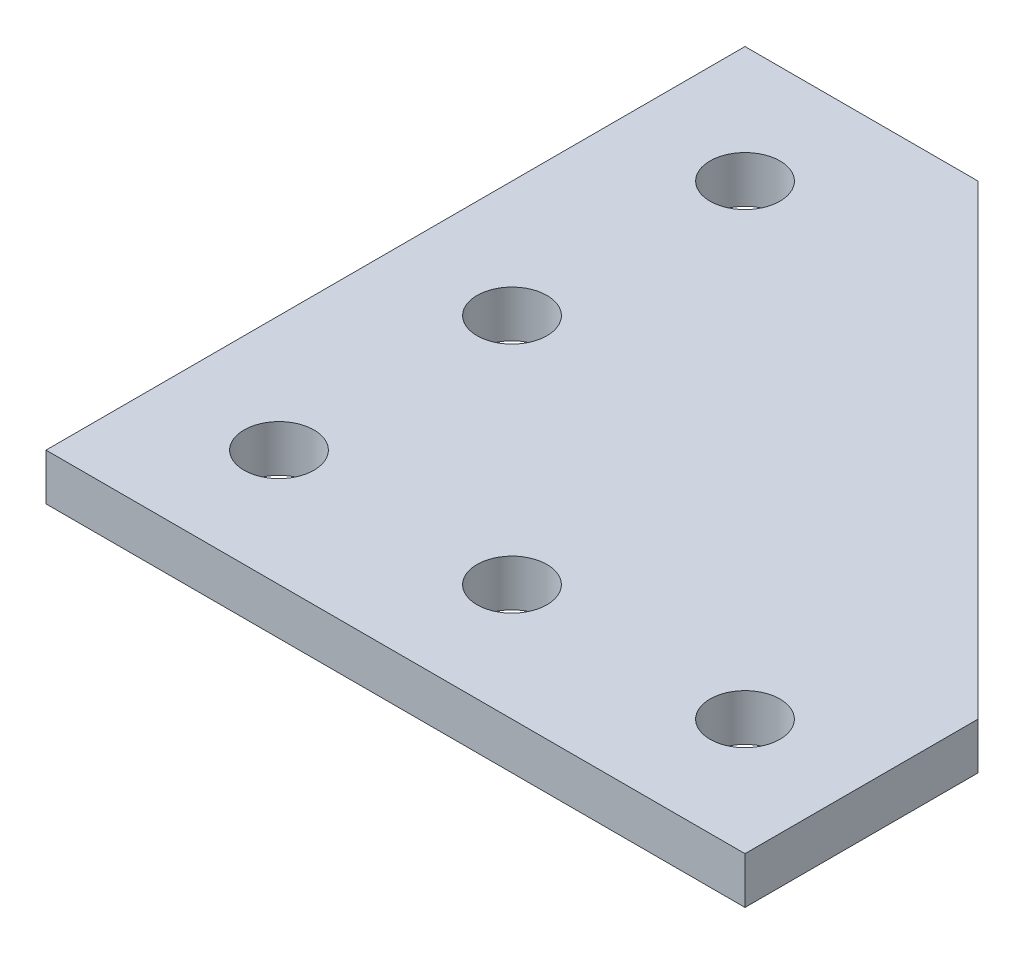
ISO-10303-21;
HEADER;
FILE_DESCRIPTION(('STEP AP214'),'2;1');
FILE_NAME('part.step','',(''),(''),'','','');
FILE_SCHEMA(('AUTOMOTIVE_DESIGN { 1 0 10303 214 1 1 1 1 }'));
ENDSEC;
DATA;
#1=APPLICATION_CONTEXT('core data for automotive mechanical design processes');
#2=APPLICATION_PROTOCOL_DEFINITION('international standard','automotive_design',2000,#1);
#3=PRODUCT_CONTEXT('',#1,'mechanical');
#4=PRODUCT('Part','Part','',(#3));
#5=PRODUCT_RELATED_PRODUCT_CATEGORY('part','',(#4));
#6=PRODUCT_DEFINITION_FORMATION('','',#4);
#7=PRODUCT_DEFINITION_CONTEXT('part definition',#1,'design');
#8=PRODUCT_DEFINITION('design','',#6,#7);
#9=PRODUCT_DEFINITION_SHAPE('','',#8);
#10=(LENGTH_UNIT() NAMED_UNIT(*) SI_UNIT(.MILLI.,.METRE.));
#11=(NAMED_UNIT(*) PLANE_ANGLE_UNIT() SI_UNIT($,.RADIAN.));
#12=(NAMED_UNIT(*) SI_UNIT($,.STERADIAN.) SOLID_ANGLE_UNIT());
#13=UNCERTAINTY_MEASURE_WITH_UNIT(LENGTH_MEASURE(1.E-05),#10,'distance_accuracy_value','');
#14=(GEOMETRIC_REPRESENTATION_CONTEXT(3) GLOBAL_UNCERTAINTY_ASSIGNED_CONTEXT((#13)) GLOBAL_UNIT_ASSIGNED_CONTEXT((#10,
#11,#12)) REPRESENTATION_CONTEXT('',''));
#15=CARTESIAN_POINT('',(0.,0.,0.));
#16=DIRECTION('',(0.,0.,1.));
#17=DIRECTION('',(1.,0.,0.));
#18=AXIS2_PLACEMENT_3D('',#15,#16,#17);
#19=CARTESIAN_POINT('',(60.,4.,0.));
#20=DIRECTION('',(0.,0.,-1.));
#21=DIRECTION('',(-1.,0.,0.));
#22=AXIS2_PLACEMENT_3D('',#19,#20,#21);
#23=PLANE('',#22);
#24=DIRECTION('',(1.,0.,0.));
#25=VECTOR('',#24,1.);
#26=CARTESIAN_POINT('',(60.,0.,0.));
#27=LINE('',#26,#25);
#28=CARTESIAN_POINT('',(0.,0.,0.));
#29=VERTEX_POINT('',#28);
#30=CARTESIAN_POINT('',(60.,0.,0.));
#31=VERTEX_POINT('',#30);
#32=EDGE_CURVE('E115',#29,#31,#27,.T.);
#33=ORIENTED_EDGE('',*,*,#32,.T.);
#34=DIRECTION('',(0.,-1.,0.));
#35=VECTOR('',#34,1.);
#36=CARTESIAN_POINT('',(60.,4.,0.));
#37=LINE('',#36,#35);
#38=CARTESIAN_POINT('',(60.,4.,0.));
#39=VERTEX_POINT('',#38);
#40=EDGE_CURVE('E11',#39,#31,#37,.T.);
#41=ORIENTED_EDGE('',*,*,#40,.F.);
#42=DIRECTION('',(1.,0.,0.));
#43=VECTOR('',#42,1.);
#44=CARTESIAN_POINT('',(60.,4.,0.));
#45=LINE('',#44,#43);
#46=CARTESIAN_POINT('',(0.,4.,0.));
#47=VERTEX_POINT('',#46);
#48=EDGE_CURVE('E124',#47,#39,#45,.T.);
#49=ORIENTED_EDGE('',*,*,#48,.F.);
#50=DIRECTION('',(0.,-1.,0.));
#51=VECTOR('',#50,1.);
#52=CARTESIAN_POINT('',(0.,4.,0.));
#53=LINE('',#52,#51);
#54=EDGE_CURVE('E111',#47,#29,#53,.T.);
#55=ORIENTED_EDGE('',*,*,#54,.T.);
#56=EDGE_LOOP('',(#33,#41,#49,#55));
#57=FACE_BOUND('',#56,.T.);
#58=ADVANCED_FACE('F41',(#57),#23,.F.);
#59=CARTESIAN_POINT('',(60.,4.,-20.));
#60=DIRECTION('',(-1.,0.,0.));
#61=DIRECTION('',(0.,0.,1.));
#62=AXIS2_PLACEMENT_3D('',#59,#60,#61);
#63=PLANE('',#62);
#64=DIRECTION('',(0.,0.,-1.));
#65=VECTOR('',#64,1.);
#66=CARTESIAN_POINT('',(60.,0.,-20.));
#67=LINE('',#66,#65);
#68=CARTESIAN_POINT('',(60.,0.,-20.));
#69=VERTEX_POINT('',#68);
#70=EDGE_CURVE('E118',#31,#69,#67,.T.);
#71=ORIENTED_EDGE('',*,*,#70,.T.);
#72=DIRECTION('',(0.,-1.,0.));
#73=VECTOR('',#72,1.);
#74=CARTESIAN_POINT('',(60.,4.,-20.));
#75=LINE('',#74,#73);
#76=CARTESIAN_POINT('',(60.,4.,-20.));
#77=VERTEX_POINT('',#76);
#78=EDGE_CURVE('E49',#77,#69,#75,.T.);
#79=ORIENTED_EDGE('',*,*,#78,.F.);
#80=DIRECTION('',(0.,0.,-1.));
#81=VECTOR('',#80,1.);
#82=CARTESIAN_POINT('',(60.,4.,-20.));
#83=LINE('',#82,#81);
#84=EDGE_CURVE('E91',#39,#77,#83,.T.);
#85=ORIENTED_EDGE('',*,*,#84,.F.);
#86=ORIENTED_EDGE('',*,*,#40,.T.);
#87=EDGE_LOOP('',(#71,#79,#85,#86));
#88=FACE_BOUND('',#87,.T.);
#89=ADVANCED_FACE('F144',(#88),#63,.F.);
#90=CARTESIAN_POINT('',(20.,4.,-60.));
#91=DIRECTION('',(-0.707106781186547,0.,0.707106781186547));
#92=DIRECTION('',(0.707106781186548,0.,0.707106781186548));
#93=AXIS2_PLACEMENT_3D('',#90,#91,#92);
#94=PLANE('',#93);
#95=DIRECTION('',(-0.707106781186548,0.,-0.707106781186548));
#96=VECTOR('',#95,1.);
#97=CARTESIAN_POINT('',(20.,0.,-60.));
#98=LINE('',#97,#96);
#99=CARTESIAN_POINT('',(20.,0.,-60.));
#100=VERTEX_POINT('',#99);
#101=EDGE_CURVE('E106',#69,#100,#98,.T.);
#102=ORIENTED_EDGE('',*,*,#101,.T.);
#103=DIRECTION('',(0.,-1.,0.));
#104=VECTOR('',#103,1.);
#105=CARTESIAN_POINT('',(20.,4.,-60.));
#106=LINE('',#105,#104);
#107=CARTESIAN_POINT('',(20.,4.,-60.));
#108=VERTEX_POINT('',#107);
#109=EDGE_CURVE('E103',#108,#100,#106,.T.);
#110=ORIENTED_EDGE('',*,*,#109,.F.);
#111=DIRECTION('',(-0.707106781186548,0.,-0.707106781186548));
#112=VECTOR('',#111,1.);
#113=CARTESIAN_POINT('',(20.,4.,-60.));
#114=LINE('',#113,#112);
#115=EDGE_CURVE('E95',#77,#108,#114,.T.);
#116=ORIENTED_EDGE('',*,*,#115,.F.);
#117=ORIENTED_EDGE('',*,*,#78,.T.);
#118=EDGE_LOOP('',(#102,#110,#116,#117));
#119=FACE_BOUND('',#118,.T.);
#120=ADVANCED_FACE('F104',(#119),#94,.F.);
#121=CARTESIAN_POINT('',(0.,4.,-60.));
#122=DIRECTION('',(0.,0.,1.));
#123=DIRECTION('',(1.,0.,0.));
#124=AXIS2_PLACEMENT_3D('',#121,#122,#123);
#125=PLANE('',#124);
#126=DIRECTION('',(-1.,0.,0.));
#127=VECTOR('',#126,1.);
#128=CARTESIAN_POINT('',(0.,0.,-60.));
#129=LINE('',#128,#127);
#130=CARTESIAN_POINT('',(0.,0.,-60.));
#131=VERTEX_POINT('',#130);
#132=EDGE_CURVE('E77',#100,#131,#129,.T.);
#133=ORIENTED_EDGE('',*,*,#132,.T.);
#134=DIRECTION('',(0.,-1.,0.));
#135=VECTOR('',#134,1.);
#136=CARTESIAN_POINT('',(0.,4.,-60.));
#137=LINE('',#136,#135);
#138=CARTESIAN_POINT('',(0.,4.,-60.));
#139=VERTEX_POINT('',#138);
#140=EDGE_CURVE('E107',#139,#131,#137,.T.);
#141=ORIENTED_EDGE('',*,*,#140,.F.);
#142=DIRECTION('',(-1.,0.,0.));
#143=VECTOR('',#142,1.);
#144=CARTESIAN_POINT('',(0.,4.,-60.));
#145=LINE('',#144,#143);
#146=EDGE_CURVE('E99',#108,#139,#145,.T.);
#147=ORIENTED_EDGE('',*,*,#146,.F.);
#148=ORIENTED_EDGE('',*,*,#109,.T.);
#149=EDGE_LOOP('',(#133,#141,#147,#148));
#150=FACE_BOUND('',#149,.T.);
#151=ADVANCED_FACE('F109',(#150),#125,.F.);
#152=CARTESIAN_POINT('',(0.,4.,0.));
#153=DIRECTION('',(1.,0.,0.));
#154=DIRECTION('',(0.,0.,-1.));
#155=AXIS2_PLACEMENT_3D('',#152,#153,#154);
#156=PLANE('',#155);
#157=DIRECTION('',(0.,0.,1.));
#158=VECTOR('',#157,1.);
#159=CARTESIAN_POINT('',(0.,0.,0.));
#160=LINE('',#159,#158);
#161=EDGE_CURVE('E83',#131,#29,#160,.T.);
#162=ORIENTED_EDGE('',*,*,#161,.T.);
#163=ORIENTED_EDGE('',*,*,#54,.F.);
#164=DIRECTION('',(0.,0.,1.));
#165=VECTOR('',#164,1.);
#166=CARTESIAN_POINT('',(0.,4.,0.));
#167=LINE('',#166,#165);
#168=EDGE_CURVE('E57',#139,#47,#167,.T.);
#169=ORIENTED_EDGE('',*,*,#168,.F.);
#170=ORIENTED_EDGE('',*,*,#140,.T.);
#171=EDGE_LOOP('',(#162,#163,#169,#170));
#172=FACE_BOUND('',#171,.T.);
#173=ADVANCED_FACE('F132',(#172),#156,.F.);
#174=CARTESIAN_POINT('',(0.,4.,0.));
#175=DIRECTION('',(0.,-1.,0.));
#176=DIRECTION('',(0.,0.,-1.));
#177=AXIS2_PLACEMENT_3D('',#174,#175,#176);
#178=PLANE('',#177);
#179=CARTESIAN_POINT('',(9.99999999999999,4.,-30.));
#180=DIRECTION('',(0.,1.,0.));
#181=DIRECTION('',(0.,0.,-1.));
#182=AXIS2_PLACEMENT_3D('',#179,#180,#181);
#183=CIRCLE('',#182,3.);
#184=CARTESIAN_POINT('',(9.99999999999999,4.,-33.));
#185=VERTEX_POINT('',#184);
#186=EDGE_CURVE('E250',#185,#185,#183,.T.);
#187=ORIENTED_EDGE('',*,*,#186,.F.);
#188=EDGE_LOOP('',(#187));
#189=FACE_BOUND('',#188,.T.);
#190=CARTESIAN_POINT('',(9.99999999999999,4.,-50.));
#191=DIRECTION('',(0.,1.,0.));
#192=DIRECTION('',(0.,0.,-1.));
#193=AXIS2_PLACEMENT_3D('',#190,#191,#192);
#194=CIRCLE('',#193,3.);
#195=CARTESIAN_POINT('',(9.99999999999999,4.,-53.));
#196=VERTEX_POINT('',#195);
#197=EDGE_CURVE('E254',#196,#196,#194,.T.);
#198=ORIENTED_EDGE('',*,*,#197,.F.);
#199=EDGE_LOOP('',(#198));
#200=FACE_BOUND('',#199,.T.);
#201=CARTESIAN_POINT('',(50.,4.,-10.));
#202=DIRECTION('',(0.,1.,0.));
#203=DIRECTION('',(0.,0.,1.));
#204=AXIS2_PLACEMENT_3D('',#201,#202,#203);
#205=CIRCLE('',#204,3.);
#206=CARTESIAN_POINT('',(50.,4.,-7.));
#207=VERTEX_POINT('',#206);
#208=EDGE_CURVE('E273',#207,#207,#205,.T.);
#209=ORIENTED_EDGE('',*,*,#208,.F.);
#210=EDGE_LOOP('',(#209));
#211=FACE_BOUND('',#210,.T.);
#212=CARTESIAN_POINT('',(10.,4.,-10.));
#213=DIRECTION('',(0.,1.,0.));
#214=DIRECTION('',(0.,0.,1.));
#215=AXIS2_PLACEMENT_3D('',#212,#213,#214);
#216=CIRCLE('',#215,3.);
#217=CARTESIAN_POINT('',(10.,4.,-7.));
#218=VERTEX_POINT('',#217);
#219=EDGE_CURVE('E264',#218,#218,#216,.T.);
#220=ORIENTED_EDGE('',*,*,#219,.F.);
#221=EDGE_LOOP('',(#220));
#222=FACE_BOUND('',#221,.T.);
#223=CARTESIAN_POINT('',(30.,4.,-10.));
#224=DIRECTION('',(0.,1.,0.));
#225=DIRECTION('',(0.,0.,1.));
#226=AXIS2_PLACEMENT_3D('',#223,#224,#225);
#227=CIRCLE('',#226,3.);
#228=CARTESIAN_POINT('',(30.,4.,-7.));
#229=VERTEX_POINT('',#228);
#230=EDGE_CURVE('E261',#229,#229,#227,.T.);
#231=ORIENTED_EDGE('',*,*,#230,.F.);
#232=EDGE_LOOP('',(#231));
#233=FACE_BOUND('',#232,.T.);
#234=ORIENTED_EDGE('',*,*,#48,.T.);
#235=ORIENTED_EDGE('',*,*,#84,.T.);
#236=ORIENTED_EDGE('',*,*,#115,.T.);
#237=ORIENTED_EDGE('',*,*,#146,.T.);
#238=ORIENTED_EDGE('',*,*,#168,.T.);
#239=EDGE_LOOP('',(#234,#235,#236,#237,#238));
#240=FACE_BOUND('',#239,.T.);
#241=ADVANCED_FACE('F97',(#189,#200,#211,#222,#233,#240),#178,.F.);
#242=CARTESIAN_POINT('',(0.,0.,0.));
#243=DIRECTION('',(0.,-1.,0.));
#244=DIRECTION('',(0.,0.,-1.));
#245=AXIS2_PLACEMENT_3D('',#242,#243,#244);
#246=PLANE('',#245);
#247=CARTESIAN_POINT('',(9.99999999999999,0.,-30.));
#248=DIRECTION('',(0.,1.,0.));
#249=DIRECTION('',(0.,0.,-1.));
#250=AXIS2_PLACEMENT_3D('',#247,#248,#249);
#251=CIRCLE('',#250,3.);
#252=CARTESIAN_POINT('',(9.99999999999999,0.,-33.));
#253=VERTEX_POINT('',#252);
#254=EDGE_CURVE('E247',#253,#253,#251,.T.);
#255=ORIENTED_EDGE('',*,*,#254,.T.);
#256=EDGE_LOOP('',(#255));
#257=FACE_BOUND('',#256,.T.);
#258=CARTESIAN_POINT('',(9.99999999999999,0.,-50.));
#259=DIRECTION('',(0.,1.,0.));
#260=DIRECTION('',(0.,0.,-1.));
#261=AXIS2_PLACEMENT_3D('',#258,#259,#260);
#262=CIRCLE('',#261,3.);
#263=CARTESIAN_POINT('',(9.99999999999999,0.,-53.));
#264=VERTEX_POINT('',#263);
#265=EDGE_CURVE('E251',#264,#264,#262,.T.);
#266=ORIENTED_EDGE('',*,*,#265,.T.);
#267=EDGE_LOOP('',(#266));
#268=FACE_BOUND('',#267,.T.);
#269=CARTESIAN_POINT('',(50.,0.,-10.));
#270=DIRECTION('',(0.,1.,0.));
#271=DIRECTION('',(0.,0.,1.));
#272=AXIS2_PLACEMENT_3D('',#269,#270,#271);
#273=CIRCLE('',#272,3.);
#274=CARTESIAN_POINT('',(50.,0.,-7.));
#275=VERTEX_POINT('',#274);
#276=EDGE_CURVE('E278',#275,#275,#273,.T.);
#277=ORIENTED_EDGE('',*,*,#276,.T.);
#278=EDGE_LOOP('',(#277));
#279=FACE_BOUND('',#278,.T.);
#280=CARTESIAN_POINT('',(10.,0.,-10.));
#281=DIRECTION('',(0.,1.,0.));
#282=DIRECTION('',(0.,0.,1.));
#283=AXIS2_PLACEMENT_3D('',#280,#281,#282);
#284=CIRCLE('',#283,3.);
#285=CARTESIAN_POINT('',(10.,0.,-7.));
#286=VERTEX_POINT('',#285);
#287=EDGE_CURVE('E268',#286,#286,#284,.T.);
#288=ORIENTED_EDGE('',*,*,#287,.T.);
#289=EDGE_LOOP('',(#288));
#290=FACE_BOUND('',#289,.T.);
#291=CARTESIAN_POINT('',(30.,0.,-10.));
#292=DIRECTION('',(0.,1.,0.));
#293=DIRECTION('',(0.,0.,1.));
#294=AXIS2_PLACEMENT_3D('',#291,#292,#293);
#295=CIRCLE('',#294,3.);
#296=CARTESIAN_POINT('',(30.,0.,-7.));
#297=VERTEX_POINT('',#296);
#298=EDGE_CURVE('E119',#297,#297,#295,.T.);
#299=ORIENTED_EDGE('',*,*,#298,.T.);
#300=EDGE_LOOP('',(#299));
#301=FACE_BOUND('',#300,.T.);
#302=ORIENTED_EDGE('',*,*,#32,.F.);
#303=ORIENTED_EDGE('',*,*,#161,.F.);
#304=ORIENTED_EDGE('',*,*,#132,.F.);
#305=ORIENTED_EDGE('',*,*,#101,.F.);
#306=ORIENTED_EDGE('',*,*,#70,.F.);
#307=EDGE_LOOP('',(#302,#303,#304,#305,#306));
#308=FACE_BOUND('',#307,.T.);
#309=ADVANCED_FACE('F128',(#257,#268,#279,#290,#301,#308),#246,.T.);
#310=CARTESIAN_POINT('',(30.,0.,-10.));
#311=DIRECTION('',(0.,1.,0.));
#312=DIRECTION('',(0.,0.,1.));
#313=AXIS2_PLACEMENT_3D('',#310,#311,#312);
#314=CYLINDRICAL_SURFACE('',#313,3.);
#315=ORIENTED_EDGE('',*,*,#298,.F.);
#316=EDGE_LOOP('',(#315));
#317=FACE_BOUND('',#316,.T.);
#318=ORIENTED_EDGE('',*,*,#230,.T.);
#319=EDGE_LOOP('',(#318));
#320=FACE_BOUND('',#319,.T.);
#321=ADVANCED_FACE('F178',(#317,#320),#314,.F.);
#322=CARTESIAN_POINT('',(10.,0.,-10.));
#323=DIRECTION('',(0.,1.,0.));
#324=DIRECTION('',(0.,0.,1.));
#325=AXIS2_PLACEMENT_3D('',#322,#323,#324);
#326=CYLINDRICAL_SURFACE('',#325,3.);
#327=ORIENTED_EDGE('',*,*,#287,.F.);
#328=EDGE_LOOP('',(#327));
#329=FACE_BOUND('',#328,.T.);
#330=ORIENTED_EDGE('',*,*,#219,.T.);
#331=EDGE_LOOP('',(#330));
#332=FACE_BOUND('',#331,.T.);
#333=ADVANCED_FACE('F186',(#329,#332),#326,.F.);
#334=CARTESIAN_POINT('',(50.,0.,-10.));
#335=DIRECTION('',(0.,1.,0.));
#336=DIRECTION('',(0.,0.,1.));
#337=AXIS2_PLACEMENT_3D('',#334,#335,#336);
#338=CYLINDRICAL_SURFACE('',#337,3.);
#339=ORIENTED_EDGE('',*,*,#276,.F.);
#340=EDGE_LOOP('',(#339));
#341=FACE_BOUND('',#340,.T.);
#342=ORIENTED_EDGE('',*,*,#208,.T.);
#343=EDGE_LOOP('',(#342));
#344=FACE_BOUND('',#343,.T.);
#345=ADVANCED_FACE('F195',(#341,#344),#338,.F.);
#346=CARTESIAN_POINT('',(9.99999999999999,0.,-50.));
#347=DIRECTION('',(0.,1.,0.));
#348=DIRECTION('',(0.,0.,1.));
#349=AXIS2_PLACEMENT_3D('',#346,#347,#348);
#350=CYLINDRICAL_SURFACE('',#349,3.);
#351=ORIENTED_EDGE('',*,*,#265,.F.);
#352=EDGE_LOOP('',(#351));
#353=FACE_BOUND('',#352,.T.);
#354=ORIENTED_EDGE('',*,*,#197,.T.);
#355=EDGE_LOOP('',(#354));
#356=FACE_BOUND('',#355,.T.);
#357=ADVANCED_FACE('F204',(#353,#356),#350,.F.);
#358=CARTESIAN_POINT('',(9.99999999999999,0.,-30.));
#359=DIRECTION('',(0.,1.,0.));
#360=DIRECTION('',(0.,0.,1.));
#361=AXIS2_PLACEMENT_3D('',#358,#359,#360);
#362=CYLINDRICAL_SURFACE('',#361,3.);
#363=ORIENTED_EDGE('',*,*,#254,.F.);
#364=EDGE_LOOP('',(#363));
#365=FACE_BOUND('',#364,.T.);
#366=ORIENTED_EDGE('',*,*,#186,.T.);
#367=EDGE_LOOP('',(#366));
#368=FACE_BOUND('',#367,.T.);
#369=ADVANCED_FACE('F213',(#365,#368),#362,.F.);
#370=CLOSED_SHELL('',(#58,#89,#120,#151,#173,#241,#309,#321,#333,#345,#357,#369));
#371=MANIFOLD_SOLID_BREP('B2',#370);
#372=ADVANCED_BREP_SHAPE_REPRESENTATION('',(#18,#371),#14);
#373=SHAPE_DEFINITION_REPRESENTATION(#9,#372);
ENDSEC;
END-ISO-10303-21;
